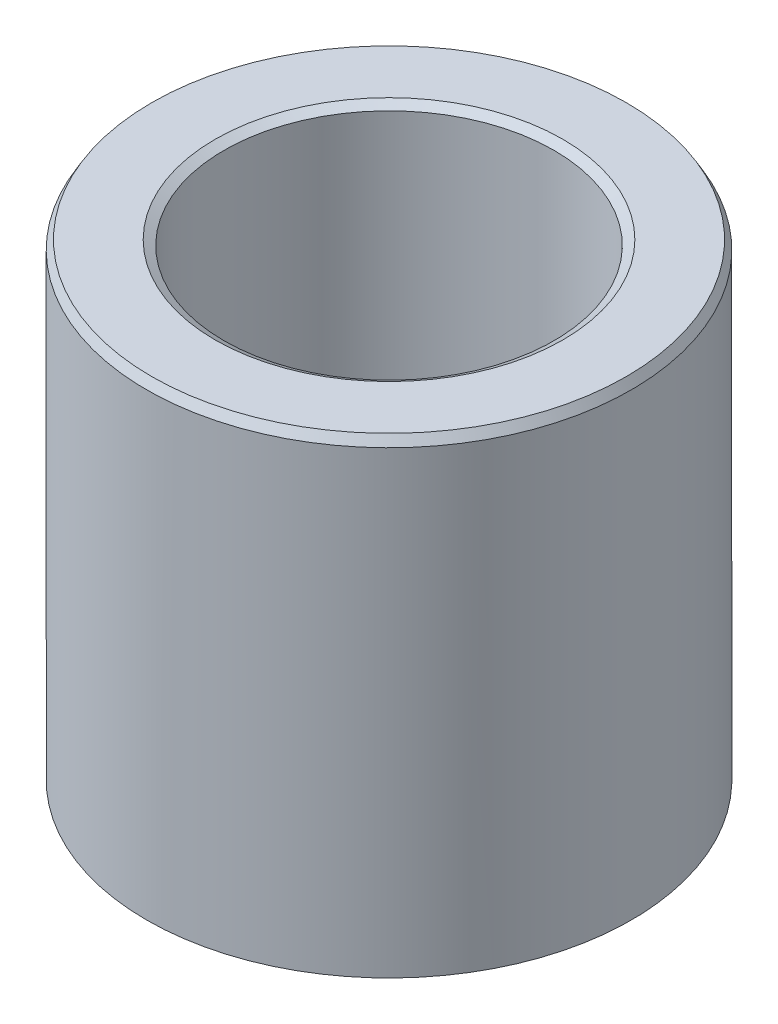
ISO-10303-21;
HEADER;
FILE_DESCRIPTION(('STEP AP214'),'2;1');
FILE_NAME('part.step','',(''),(''),'','','');
FILE_SCHEMA(('AUTOMOTIVE_DESIGN { 1 0 10303 214 1 1 1 1 }'));
ENDSEC;
DATA;
#1=APPLICATION_CONTEXT('core data for automotive mechanical design processes');
#2=APPLICATION_PROTOCOL_DEFINITION('international standard','automotive_design',2000,#1);
#3=PRODUCT_CONTEXT('',#1,'mechanical');
#4=PRODUCT('Part','Part','',(#3));
#5=PRODUCT_RELATED_PRODUCT_CATEGORY('part','',(#4));
#6=PRODUCT_DEFINITION_FORMATION('','',#4);
#7=PRODUCT_DEFINITION_CONTEXT('part definition',#1,'design');
#8=PRODUCT_DEFINITION('design','',#6,#7);
#9=PRODUCT_DEFINITION_SHAPE('','',#8);
#10=(LENGTH_UNIT() NAMED_UNIT(*) SI_UNIT(.MILLI.,.METRE.));
#11=(NAMED_UNIT(*) PLANE_ANGLE_UNIT() SI_UNIT($,.RADIAN.));
#12=(NAMED_UNIT(*) SI_UNIT($,.STERADIAN.) SOLID_ANGLE_UNIT());
#13=UNCERTAINTY_MEASURE_WITH_UNIT(LENGTH_MEASURE(1.E-05),#10,'distance_accuracy_value','');
#14=(GEOMETRIC_REPRESENTATION_CONTEXT(3) GLOBAL_UNCERTAINTY_ASSIGNED_CONTEXT((#13)) GLOBAL_UNIT_ASSIGNED_CONTEXT((#10,
#11,#12)) REPRESENTATION_CONTEXT('',''));
#15=CARTESIAN_POINT('',(0.,0.,0.));
#16=DIRECTION('',(0.,0.,1.));
#17=DIRECTION('',(1.,0.,0.));
#18=AXIS2_PLACEMENT_3D('',#15,#16,#17);
#19=CARTESIAN_POINT('',(0.,117.126722497335,0.));
#20=DIRECTION('',(0.,-1.,0.));
#21=DIRECTION('',(0.,0.,-1.));
#22=AXIS2_PLACEMENT_3D('',#19,#20,#21);
#23=CYLINDRICAL_SURFACE('',#22,60.);
#24=CARTESIAN_POINT('',(0.,1.26784081213609,0.));
#25=DIRECTION('',(0.,1.,0.));
#26=DIRECTION('',(0.,0.,1.));
#27=AXIS2_PLACEMENT_3D('',#24,#25,#26);
#28=CIRCLE('',#27,60.);
#29=CARTESIAN_POINT('',(0.,1.26784081213607,-60.));
#30=VERTEX_POINT('',#29);
#31=EDGE_CURVE('E10',#30,#30,#28,.T.);
#32=CARTESIAN_POINT('',(0.,114.930757794806,0.));
#33=DIRECTION('',(0.,1.,0.));
#34=DIRECTION('',(0.,0.,1.));
#35=AXIS2_PLACEMENT_3D('',#32,#33,#34);
#36=CIRCLE('',#35,60.);
#37=CARTESIAN_POINT('',(0.,114.930757794806,-60.));
#38=VERTEX_POINT('',#37);
#39=EDGE_CURVE('E50',#38,#38,#36,.F.);
#40=CARTESIAN_POINT('',(0.,1.26784081213607,-60.));
#41=CARTESIAN_POINT('',(0.,2.45182953070555,-60.));
#42=CARTESIAN_POINT('',(0.,3.63581824927502,-60.));
#43=CARTESIAN_POINT('',(0.,6.00379568641397,-60.));
#44=CARTESIAN_POINT('',(0.,7.18778440498345,-60.));
#45=CARTESIAN_POINT('',(0.,9.5557618421224,-60.));
#46=CARTESIAN_POINT('',(0.,10.7397505606919,-60.));
#47=CARTESIAN_POINT('',(0.,13.1077279978308,-60.));
#48=CARTESIAN_POINT('',(0.,14.2917167164003,-60.));
#49=CARTESIAN_POINT('',(0.,16.6596941535392,-60.));
#50=CARTESIAN_POINT('',(0.,17.8436828721087,-60.));
#51=CARTESIAN_POINT('',(0.,20.2116603092477,-60.));
#52=CARTESIAN_POINT('',(0.,21.3956490278172,-60.));
#53=CARTESIAN_POINT('',(0.,23.7636264649561,-60.));
#54=CARTESIAN_POINT('',(0.,24.9476151835256,-60.));
#55=CARTESIAN_POINT('',(0.,27.3155926206645,-60.));
#56=CARTESIAN_POINT('',(0.,28.499581339234,-60.));
#57=CARTESIAN_POINT('',(0.,30.867558776373,-60.));
#58=CARTESIAN_POINT('',(0.,32.0515474949424,-60.));
#59=CARTESIAN_POINT('',(0.,34.4195249320814,-60.));
#60=CARTESIAN_POINT('',(0.,35.6035136506509,-60.));
#61=CARTESIAN_POINT('',(0.,37.9714910877898,-60.));
#62=CARTESIAN_POINT('',(0.,39.1554798063593,-60.));
#63=CARTESIAN_POINT('',(0.,41.5234572434982,-60.));
#64=CARTESIAN_POINT('',(0.,42.7074459620677,-60.));
#65=CARTESIAN_POINT('',(0.,45.0754233992067,-60.));
#66=CARTESIAN_POINT('',(0.,46.2594121177761,-60.));
#67=CARTESIAN_POINT('',(0.,48.6273895549151,-60.));
#68=CARTESIAN_POINT('',(0.,49.8113782734846,-60.));
#69=CARTESIAN_POINT('',(0.,52.1793557106235,-60.));
#70=CARTESIAN_POINT('',(0.,53.363344429193,-60.));
#71=CARTESIAN_POINT('',(0.,55.7313218663319,-60.));
#72=CARTESIAN_POINT('',(0.,56.9153105849014,-60.));
#73=CARTESIAN_POINT('',(0.,59.2832880220404,-60.));
#74=CARTESIAN_POINT('',(0.,60.4672767406098,-60.));
#75=CARTESIAN_POINT('',(0.,62.8352541777488,-60.));
#76=CARTESIAN_POINT('',(0.,64.0192428963183,-60.));
#77=CARTESIAN_POINT('',(0.,66.3872203334572,-60.));
#78=CARTESIAN_POINT('',(0.,67.5712090520267,-60.));
#79=CARTESIAN_POINT('',(0.,69.9391864891656,-60.));
#80=CARTESIAN_POINT('',(0.,71.1231752077351,-60.));
#81=CARTESIAN_POINT('',(0.,73.4911526448741,-60.));
#82=CARTESIAN_POINT('',(0.,74.6751413634436,-60.));
#83=CARTESIAN_POINT('',(0.,77.0431188005825,-60.));
#84=CARTESIAN_POINT('',(0.,78.227107519152,-60.));
#85=CARTESIAN_POINT('',(0.,80.5950849562909,-60.));
#86=CARTESIAN_POINT('',(0.,81.7790736748604,-60.));
#87=CARTESIAN_POINT('',(0.,84.1470511119994,-60.));
#88=CARTESIAN_POINT('',(0.,85.3310398305688,-60.));
#89=CARTESIAN_POINT('',(0.,87.6990172677078,-60.));
#90=CARTESIAN_POINT('',(0.,88.8830059862772,-60.));
#91=CARTESIAN_POINT('',(0.,91.2509834234162,-60.));
#92=CARTESIAN_POINT('',(0.,92.4349721419857,-60.));
#93=CARTESIAN_POINT('',(0.,94.8029495791246,-60.));
#94=CARTESIAN_POINT('',(0.,95.9869382976941,-60.));
#95=CARTESIAN_POINT('',(0.,98.354915734833,-60.));
#96=CARTESIAN_POINT('',(0.,99.5389044534025,-60.));
#97=CARTESIAN_POINT('',(0.,101.906881890541,-60.));
#98=CARTESIAN_POINT('',(0.,103.090870609111,-60.));
#99=CARTESIAN_POINT('',(0.,105.45884804625,-60.));
#100=CARTESIAN_POINT('',(0.,106.642836764819,-60.));
#101=CARTESIAN_POINT('',(0.,109.010814201958,-60.));
#102=CARTESIAN_POINT('',(0.,110.194802920528,-60.));
#103=CARTESIAN_POINT('',(0.,112.562780357667,-60.));
#104=CARTESIAN_POINT('',(0.,113.746769076236,-60.));
#105=CARTESIAN_POINT('',(0.,114.930757794806,-60.));
#106=B_SPLINE_CURVE_WITH_KNOTS('',3,(#40,#41,#42,#43,#44,#45,#46,#47,#48,#49,#50,#51,#52,#53,
#54,#55,#56,#57,#58,#59,#60,#61,#62,#63,#64,#65,#66,#67,#68,#69,#70,#71,#72,#73,#74,#75,#76,#77,
#78,#79,#80,#81,#82,#83,#84,#85,#86,#87,#88,#89,#90,#91,#92,#93,#94,#95,#96,#97,#98,#99,#100,
#101,#102,#103,#104,#105),.UNSPECIFIED.,.F.,.F.,(4,2,2,2,2,2,2,2,2,2,2,2,2,2,2,2,2,2,2,2,2,2,2,
2,2,2,2,2,2,2,2,2,4),(0.,3.55196615570842,7.10393231141686,10.6558984671253,14.2078646228337,
17.7598307785421,21.3117969342506,24.863763089959,28.4157292456674,31.9676954013758,
35.5196615570843,39.0716277127927,42.6235938685011,46.1755600242095,49.727526179918,
53.2794923356264,56.8314584913348,60.3834246470432,63.9353908027517,67.4873569584601,
71.0393231141685,74.591289269877,78.1432554255854,81.6952215812938,85.2471877370022,
88.7991538927106,92.3511200484191,95.9030862041275,99.4550523598359,103.007018515544,
106.558984671253,110.110950826961,113.66291698267),.UNSPECIFIED.);
#107=EDGE_CURVE('BSEAM39',#30,#38,#106,.T.);
#108=ORIENTED_EDGE('',*,*,#31,.T.);
#109=ORIENTED_EDGE('',*,*,#39,.T.);
#110=ORIENTED_EDGE('',*,*,#107,.T.);
#111=ORIENTED_EDGE('',*,*,#107,.F.);
#112=EDGE_LOOP('',(#108,#110,#109,#111));
#113=FACE_BOUND('',#112,.T.);
#114=ADVANCED_FACE('F39',(#113),#23,.T.);
#115=CARTESIAN_POINT('',(0.,117.126722497335,0.));
#116=DIRECTION('',(0.,1.,0.));
#117=DIRECTION('',(0.,0.,1.));
#118=AXIS2_PLACEMENT_3D('',#115,#116,#117);
#119=PLANE('',#118);
#120=CARTESIAN_POINT('',(0.,117.126722497335,0.));
#121=DIRECTION('',(0.,1.,0.));
#122=DIRECTION('',(0.,0.,1.));
#123=AXIS2_PLACEMENT_3D('',#120,#121,#122);
#124=CIRCLE('',#123,43.0310509647334);
#125=CARTESIAN_POINT('',(0.,117.126722497335,43.0310509647334));
#126=VERTEX_POINT('',#125);
#127=EDGE_CURVE('E58',#126,#126,#124,.F.);
#128=ORIENTED_EDGE('',*,*,#127,.T.);
#129=EDGE_LOOP('',(#128));
#130=FACE_BOUND('',#129,.T.);
#131=CARTESIAN_POINT('',(0.,117.126722497335,0.));
#132=DIRECTION('',(0.,1.,0.));
#133=DIRECTION('',(0.,0.,1.));
#134=AXIS2_PLACEMENT_3D('',#131,#132,#133);
#135=CIRCLE('',#134,58.732159187864);
#136=CARTESIAN_POINT('',(0.,117.126722497335,58.732159187864));
#137=VERTEX_POINT('',#136);
#138=EDGE_CURVE('E61',#137,#137,#135,.T.);
#139=ORIENTED_EDGE('',*,*,#138,.T.);
#140=EDGE_LOOP('',(#139));
#141=FACE_BOUND('',#140,.T.);
#142=ADVANCED_FACE('F88',(#130,#141),#119,.T.);
#143=CARTESIAN_POINT('',(0.,0.,0.));
#144=DIRECTION('',(0.,1.,0.));
#145=DIRECTION('',(0.,0.,1.));
#146=AXIS2_PLACEMENT_3D('',#143,#144,#145);
#147=PLANE('',#146);
#148=CARTESIAN_POINT('',(0.,0.,0.));
#149=DIRECTION('',(0.,1.,0.));
#150=DIRECTION('',(0.,0.,1.));
#151=AXIS2_PLACEMENT_3D('',#148,#149,#150);
#152=CIRCLE('',#151,42.1029270743403);
#153=CARTESIAN_POINT('',(0.,0.,42.1029270743403));
#154=VERTEX_POINT('',#153);
#155=EDGE_CURVE('E51',#154,#154,#152,.T.);
#156=ORIENTED_EDGE('',*,*,#155,.T.);
#157=EDGE_LOOP('',(#156));
#158=FACE_BOUND('',#157,.T.);
#159=CARTESIAN_POINT('',(0.,0.,0.));
#160=DIRECTION('',(0.,1.,0.));
#161=DIRECTION('',(0.,0.,1.));
#162=AXIS2_PLACEMENT_3D('',#159,#160,#161);
#163=CIRCLE('',#162,57.8040352974709);
#164=CARTESIAN_POINT('',(0.,0.,57.8040352974709));
#165=VERTEX_POINT('',#164);
#166=EDGE_CURVE('E54',#165,#165,#163,.F.);
#167=ORIENTED_EDGE('',*,*,#166,.T.);
#168=EDGE_LOOP('',(#167));
#169=FACE_BOUND('',#168,.T.);
#170=ADVANCED_FACE('F83',(#158,#169),#147,.F.);
#171=CARTESIAN_POINT('',(0.,117.126722497335,0.));
#172=DIRECTION('',(0.,-1.,0.));
#173=DIRECTION('',(0.,0.,-1.));
#174=AXIS2_PLACEMENT_3D('',#171,#172,#173);
#175=CYLINDRICAL_SURFACE('',#174,40.8350862622043);
#176=CARTESIAN_POINT('',(0.,115.858881685199,0.));
#177=DIRECTION('',(0.,1.,0.));
#178=DIRECTION('',(0.,0.,1.));
#179=AXIS2_PLACEMENT_3D('',#176,#177,#178);
#180=CIRCLE('',#179,40.8350862622043);
#181=CARTESIAN_POINT('',(0.,115.858881685199,-40.8350862622043));
#182=VERTEX_POINT('',#181);
#183=EDGE_CURVE('E67',#182,#182,#180,.T.);
#184=CARTESIAN_POINT('',(0.,2.19596470252889,0.));
#185=DIRECTION('',(0.,1.,0.));
#186=DIRECTION('',(0.,0.,1.));
#187=AXIS2_PLACEMENT_3D('',#184,#185,#186);
#188=CIRCLE('',#187,40.8350862622043);
#189=CARTESIAN_POINT('',(0.,2.19596470252889,-40.8350862622043));
#190=VERTEX_POINT('',#189);
#191=EDGE_CURVE('E69',#190,#190,#188,.F.);
#192=CARTESIAN_POINT('',(0.,115.858881685199,-40.8350862622043));
#193=CARTESIAN_POINT('',(0.,114.674892966629,-40.8350862622043));
#194=CARTESIAN_POINT('',(0.,113.49090424806,-40.8350862622043));
#195=CARTESIAN_POINT('',(0.,111.122926810921,-40.8350862622043));
#196=CARTESIAN_POINT('',(0.,109.938938092351,-40.8350862622043));
#197=CARTESIAN_POINT('',(0.,107.570960655212,-40.8350862622043));
#198=CARTESIAN_POINT('',(0.,106.386971936643,-40.8350862622043));
#199=CARTESIAN_POINT('',(0.,104.018994499504,-40.8350862622043));
#200=CARTESIAN_POINT('',(0.,102.835005780934,-40.8350862622043));
#201=CARTESIAN_POINT('',(0.,100.467028343795,-40.8350862622043));
#202=CARTESIAN_POINT('',(0.,99.2830396252259,-40.8350862622043));
#203=CARTESIAN_POINT('',(0.,96.9150621880869,-40.8350862622043));
#204=CARTESIAN_POINT('',(0.,95.7310734695174,-40.8350862622043));
#205=CARTESIAN_POINT('',(0.,93.3630960323785,-40.8350862622043));
#206=CARTESIAN_POINT('',(0.,92.179107313809,-40.8350862622043));
#207=CARTESIAN_POINT('',(0.,89.8111298766701,-40.8350862622043));
#208=CARTESIAN_POINT('',(0.,88.6271411581006,-40.8350862622043));
#209=CARTESIAN_POINT('',(0.,86.2591637209616,-40.8350862622043));
#210=CARTESIAN_POINT('',(0.,85.0751750023922,-40.8350862622043));
#211=CARTESIAN_POINT('',(0.,82.7071975652532,-40.8350862622043));
#212=CARTESIAN_POINT('',(0.,81.5232088466837,-40.8350862622043));
#213=CARTESIAN_POINT('',(0.,79.1552314095448,-40.8350862622043));
#214=CARTESIAN_POINT('',(0.,77.9712426909753,-40.8350862622043));
#215=CARTESIAN_POINT('',(0.,75.6032652538363,-40.8350862622043));
#216=CARTESIAN_POINT('',(0.,74.4192765352669,-40.8350862622043));
#217=CARTESIAN_POINT('',(0.,72.0512990981279,-40.8350862622043));
#218=CARTESIAN_POINT('',(0.,70.8673103795585,-40.8350862622043));
#219=CARTESIAN_POINT('',(0.,68.4993329424195,-40.8350862622043));
#220=CARTESIAN_POINT('',(0.,67.31534422385,-40.8350862622043));
#221=CARTESIAN_POINT('',(0.,64.9473667867111,-40.8350862622043));
#222=CARTESIAN_POINT('',(0.,63.7633780681416,-40.8350862622043));
#223=CARTESIAN_POINT('',(0.,61.3954006310027,-40.8350862622043));
#224=CARTESIAN_POINT('',(0.,60.2114119124332,-40.8350862622043));
#225=CARTESIAN_POINT('',(0.,57.8434344752942,-40.8350862622043));
#226=CARTESIAN_POINT('',(0.,56.6594457567248,-40.8350862622043));
#227=CARTESIAN_POINT('',(0.,54.2914683195858,-40.8350862622043));
#228=CARTESIAN_POINT('',(0.,53.1074796010163,-40.8350862622043));
#229=CARTESIAN_POINT('',(0.,50.7395021638774,-40.8350862622043));
#230=CARTESIAN_POINT('',(0.,49.5555134453079,-40.8350862622043));
#231=CARTESIAN_POINT('',(0.,47.1875360081689,-40.8350862622043));
#232=CARTESIAN_POINT('',(0.,46.0035472895995,-40.8350862622043));
#233=CARTESIAN_POINT('',(0.,43.6355698524605,-40.8350862622043));
#234=CARTESIAN_POINT('',(0.,42.4515811338911,-40.8350862622043));
#235=CARTESIAN_POINT('',(0.,40.0836036967521,-40.8350862622043));
#236=CARTESIAN_POINT('',(0.,38.8996149781826,-40.8350862622043));
#237=CARTESIAN_POINT('',(0.,36.5316375410437,-40.8350862622043));
#238=CARTESIAN_POINT('',(0.,35.3476488224742,-40.8350862622043));
#239=CARTESIAN_POINT('',(0.,32.9796713853353,-40.8350862622043));
#240=CARTESIAN_POINT('',(0.,31.7956826667658,-40.8350862622043));
#241=CARTESIAN_POINT('',(0.,29.4277052296268,-40.8350862622043));
#242=CARTESIAN_POINT('',(0.,28.2437165110573,-40.8350862622043));
#243=CARTESIAN_POINT('',(0.,25.8757390739184,-40.8350862622043));
#244=CARTESIAN_POINT('',(0.,24.6917503553489,-40.8350862622043));
#245=CARTESIAN_POINT('',(0.,22.32377291821,-40.8350862622043));
#246=CARTESIAN_POINT('',(0.,21.1397841996405,-40.8350862622043));
#247=CARTESIAN_POINT('',(0.,18.7718067625015,-40.8350862622043));
#248=CARTESIAN_POINT('',(0.,17.5878180439321,-40.8350862622043));
#249=CARTESIAN_POINT('',(0.,15.2198406067931,-40.8350862622043));
#250=CARTESIAN_POINT('',(0.,14.0358518882236,-40.8350862622043));
#251=CARTESIAN_POINT('',(0.,11.6678744510847,-40.8350862622043));
#252=CARTESIAN_POINT('',(0.,10.4838857325152,-40.8350862622043));
#253=CARTESIAN_POINT('',(0.,8.11590829537626,-40.8350862622043));
#254=CARTESIAN_POINT('',(0.,6.93191957680678,-40.8350862622043));
#255=CARTESIAN_POINT('',(0.,4.56394213966783,-40.8350862622043));
#256=CARTESIAN_POINT('',(0.,3.37995342109836,-40.8350862622043));
#257=CARTESIAN_POINT('',(0.,2.19596470252889,-40.8350862622043));
#258=B_SPLINE_CURVE_WITH_KNOTS('',3,(#192,#193,#194,#195,#196,#197,#198,#199,#200,#201,#202,
#203,#204,#205,#206,#207,#208,#209,#210,#211,#212,#213,#214,#215,#216,#217,#218,#219,#220,#221,
#222,#223,#224,#225,#226,#227,#228,#229,#230,#231,#232,#233,#234,#235,#236,#237,#238,#239,#240,
#241,#242,#243,#244,#245,#246,#247,#248,#249,#250,#251,#252,#253,#254,#255,#256,#257),
.UNSPECIFIED.,.F.,.F.,(4,2,2,2,2,2,2,2,2,2,2,2,2,2,2,2,2,2,2,2,2,2,2,2,2,2,2,2,2,2,2,2,4),(0.,
3.55196615570844,7.10393231141686,10.6558984671253,14.2078646228337,17.7598307785421,
21.3117969342506,24.863763089959,28.4157292456674,31.9676954013758,35.5196615570843,
39.0716277127927,42.6235938685011,46.1755600242095,49.727526179918,53.2794923356264,
56.8314584913348,60.3834246470432,63.9353908027517,67.4873569584601,71.0393231141685,
74.5912892698769,78.1432554255854,81.6952215812938,85.2471877370022,88.7991538927107,
92.3511200484191,95.9030862041275,99.4550523598359,103.007018515544,106.558984671253,
110.110950826961,113.66291698267),.UNSPECIFIED.);
#259=EDGE_CURVE('BSEAM71',#182,#190,#258,.T.);
#260=ORIENTED_EDGE('',*,*,#183,.T.);
#261=ORIENTED_EDGE('',*,*,#191,.T.);
#262=ORIENTED_EDGE('',*,*,#259,.T.);
#263=ORIENTED_EDGE('',*,*,#259,.F.);
#264=EDGE_LOOP('',(#260,#262,#261,#263));
#265=FACE_BOUND('',#264,.T.);
#266=ADVANCED_FACE('F71',(#265),#175,.F.);
#267=CARTESIAN_POINT('',(0.,115.858881685199,0.));
#268=DIRECTION('',(0.,1.,0.));
#269=DIRECTION('',(0.,0.,1.));
#270=AXIS2_PLACEMENT_3D('',#267,#268,#269);
#271=CONICAL_SURFACE('',#270,40.8350862622043,1.0471975511966);
#272=ORIENTED_EDGE('',*,*,#127,.F.);
#273=EDGE_LOOP('',(#272));
#274=FACE_BOUND('',#273,.T.);
#275=ORIENTED_EDGE('',*,*,#183,.F.);
#276=EDGE_LOOP('',(#275));
#277=FACE_BOUND('',#276,.T.);
#278=ADVANCED_FACE('F77',(#274,#277),#271,.F.);
#279=CARTESIAN_POINT('',(0.,0.,0.));
#280=DIRECTION('',(0.,-1.,0.));
#281=DIRECTION('',(0.,0.,-1.));
#282=AXIS2_PLACEMENT_3D('',#279,#280,#281);
#283=CONICAL_SURFACE('',#282,42.1029270743403,0.523598775598298);
#284=ORIENTED_EDGE('',*,*,#191,.F.);
#285=EDGE_LOOP('',(#284));
#286=FACE_BOUND('',#285,.T.);
#287=ORIENTED_EDGE('',*,*,#155,.F.);
#288=EDGE_LOOP('',(#287));
#289=FACE_BOUND('',#288,.T.);
#290=ADVANCED_FACE('F73',(#286,#289),#283,.F.);
#291=CARTESIAN_POINT('',(0.,1.26784081213609,0.));
#292=DIRECTION('',(0.,1.,0.));
#293=DIRECTION('',(0.,0.,1.));
#294=AXIS2_PLACEMENT_3D('',#291,#292,#293);
#295=CONICAL_SURFACE('',#294,60.,1.0471975511966);
#296=ORIENTED_EDGE('',*,*,#166,.F.);
#297=EDGE_LOOP('',(#296));
#298=FACE_BOUND('',#297,.T.);
#299=ORIENTED_EDGE('',*,*,#31,.F.);
#300=EDGE_LOOP('',(#299));
#301=FACE_BOUND('',#300,.T.);
#302=ADVANCED_FACE('F76',(#298,#301),#295,.T.);
#303=CARTESIAN_POINT('',(0.,117.126722497335,0.));
#304=DIRECTION('',(0.,-1.,0.));
#305=DIRECTION('',(0.,0.,-1.));
#306=AXIS2_PLACEMENT_3D('',#303,#304,#305);
#307=CONICAL_SURFACE('',#306,58.732159187864,0.523598775598296);
#308=ORIENTED_EDGE('',*,*,#39,.F.);
#309=EDGE_LOOP('',(#308));
#310=FACE_BOUND('',#309,.T.);
#311=ORIENTED_EDGE('',*,*,#138,.F.);
#312=EDGE_LOOP('',(#311));
#313=FACE_BOUND('',#312,.T.);
#314=ADVANCED_FACE('F45',(#310,#313),#307,.T.);
#315=CLOSED_SHELL('',(#114,#142,#170,#266,#278,#290,#302,#314));
#316=MANIFOLD_SOLID_BREP('B2',#315);
#317=ADVANCED_BREP_SHAPE_REPRESENTATION('',(#18,#316),#14);
#318=SHAPE_DEFINITION_REPRESENTATION(#9,#317);
ENDSEC;
END-ISO-10303-21;
